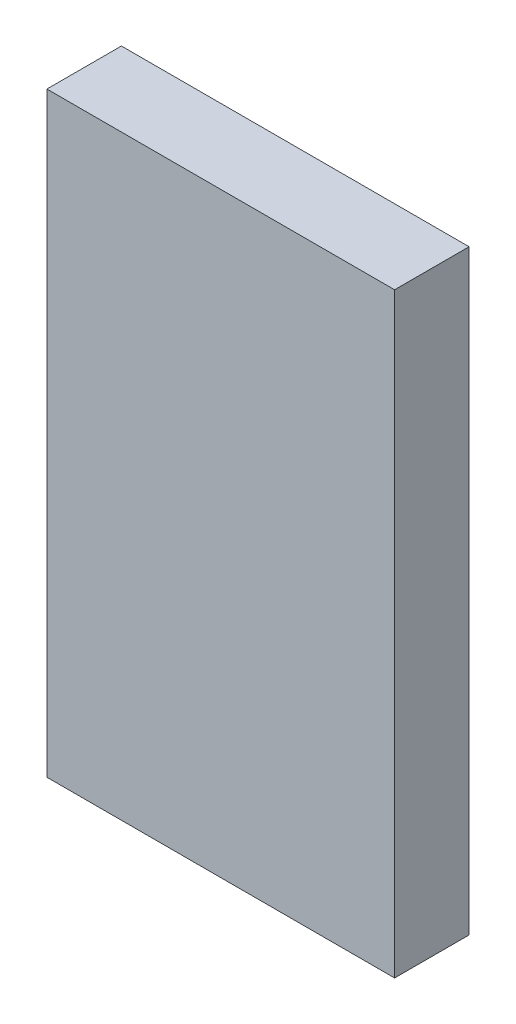
ISO-10303-21;
HEADER;
FILE_DESCRIPTION(('STEP AP214'),'2;1');
FILE_NAME('part.step','',(''),(''),'','','');
FILE_SCHEMA(('AUTOMOTIVE_DESIGN { 1 0 10303 214 1 1 1 1 }'));
ENDSEC;
DATA;
#1=APPLICATION_CONTEXT('core data for automotive mechanical design processes');
#2=APPLICATION_PROTOCOL_DEFINITION('international standard','automotive_design',2000,#1);
#3=PRODUCT_CONTEXT('',#1,'mechanical');
#4=PRODUCT('Part','Part','',(#3));
#5=PRODUCT_RELATED_PRODUCT_CATEGORY('part','',(#4));
#6=PRODUCT_DEFINITION_FORMATION('','',#4);
#7=PRODUCT_DEFINITION_CONTEXT('part definition',#1,'design');
#8=PRODUCT_DEFINITION('design','',#6,#7);
#9=PRODUCT_DEFINITION_SHAPE('','',#8);
#10=(LENGTH_UNIT() NAMED_UNIT(*) SI_UNIT(.MILLI.,.METRE.));
#11=(NAMED_UNIT(*) PLANE_ANGLE_UNIT() SI_UNIT($,.RADIAN.));
#12=(NAMED_UNIT(*) SI_UNIT($,.STERADIAN.) SOLID_ANGLE_UNIT());
#13=UNCERTAINTY_MEASURE_WITH_UNIT(LENGTH_MEASURE(1.E-05),#10,'distance_accuracy_value','');
#14=(GEOMETRIC_REPRESENTATION_CONTEXT(3) GLOBAL_UNCERTAINTY_ASSIGNED_CONTEXT((#13)) GLOBAL_UNIT_ASSIGNED_CONTEXT((#10,
#11,#12)) REPRESENTATION_CONTEXT('',''));
#15=CARTESIAN_POINT('',(0.,0.,0.));
#16=DIRECTION('',(0.,0.,1.));
#17=DIRECTION('',(1.,0.,0.));
#18=AXIS2_PLACEMENT_3D('',#15,#16,#17);
#19=CARTESIAN_POINT('',(0.,0.,7.62));
#20=DIRECTION('',(1.,0.,0.));
#21=DIRECTION('',(0.,0.,-1.));
#22=AXIS2_PLACEMENT_3D('',#19,#20,#21);
#23=PLANE('',#22);
#24=DIRECTION('',(0.,-1.,0.));
#25=VECTOR('',#24,1.);
#26=CARTESIAN_POINT('',(0.,0.,0.));
#27=LINE('',#26,#25);
#28=CARTESIAN_POINT('',(0.,60.96,0.));
#29=VERTEX_POINT('',#28);
#30=CARTESIAN_POINT('',(0.,0.,0.));
#31=VERTEX_POINT('',#30);
#32=EDGE_CURVE('E96',#29,#31,#27,.T.);
#33=ORIENTED_EDGE('',*,*,#32,.T.);
#34=DIRECTION('',(0.,0.,-1.));
#35=VECTOR('',#34,1.);
#36=CARTESIAN_POINT('',(0.,0.,7.62));
#37=LINE('',#36,#35);
#38=CARTESIAN_POINT('',(0.,0.,7.62));
#39=VERTEX_POINT('',#38);
#40=EDGE_CURVE('E11',#39,#31,#37,.T.);
#41=ORIENTED_EDGE('',*,*,#40,.F.);
#42=DIRECTION('',(0.,-1.,0.));
#43=VECTOR('',#42,1.);
#44=CARTESIAN_POINT('',(0.,0.,7.62));
#45=LINE('',#44,#43);
#46=CARTESIAN_POINT('',(0.,60.96,7.62));
#47=VERTEX_POINT('',#46);
#48=EDGE_CURVE('E84',#47,#39,#45,.T.);
#49=ORIENTED_EDGE('',*,*,#48,.F.);
#50=DIRECTION('',(0.,0.,-1.));
#51=VECTOR('',#50,1.);
#52=CARTESIAN_POINT('',(0.,60.96,7.62));
#53=LINE('',#52,#51);
#54=EDGE_CURVE('E92',#47,#29,#53,.T.);
#55=ORIENTED_EDGE('',*,*,#54,.T.);
#56=EDGE_LOOP('',(#33,#41,#49,#55));
#57=FACE_BOUND('',#56,.T.);
#58=ADVANCED_FACE('F33',(#57),#23,.F.);
#59=CARTESIAN_POINT('',(0.,0.,7.62));
#60=DIRECTION('',(0.,1.,0.));
#61=DIRECTION('',(0.,0.,1.));
#62=AXIS2_PLACEMENT_3D('',#59,#60,#61);
#63=PLANE('',#62);
#64=DIRECTION('',(1.,0.,0.));
#65=VECTOR('',#64,1.);
#66=CARTESIAN_POINT('',(0.,0.,0.));
#67=LINE('',#66,#65);
#68=CARTESIAN_POINT('',(35.56,0.,0.));
#69=VERTEX_POINT('',#68);
#70=EDGE_CURVE('E88',#31,#69,#67,.T.);
#71=ORIENTED_EDGE('',*,*,#70,.T.);
#72=DIRECTION('',(0.,0.,-1.));
#73=VECTOR('',#72,1.);
#74=CARTESIAN_POINT('',(35.56,0.,7.62));
#75=LINE('',#74,#73);
#76=CARTESIAN_POINT('',(35.56,0.,7.62));
#77=VERTEX_POINT('',#76);
#78=EDGE_CURVE('E41',#77,#69,#75,.T.);
#79=ORIENTED_EDGE('',*,*,#78,.F.);
#80=DIRECTION('',(1.,0.,0.));
#81=VECTOR('',#80,1.);
#82=CARTESIAN_POINT('',(0.,0.,7.62));
#83=LINE('',#82,#81);
#84=EDGE_CURVE('E79',#39,#77,#83,.T.);
#85=ORIENTED_EDGE('',*,*,#84,.F.);
#86=ORIENTED_EDGE('',*,*,#40,.T.);
#87=EDGE_LOOP('',(#71,#79,#85,#86));
#88=FACE_BOUND('',#87,.T.);
#89=ADVANCED_FACE('F87',(#88),#63,.F.);
#90=CARTESIAN_POINT('',(35.56,0.,7.62));
#91=DIRECTION('',(-1.,0.,0.));
#92=DIRECTION('',(0.,-1.,0.));
#93=AXIS2_PLACEMENT_3D('',#90,#91,#92);
#94=PLANE('',#93);
#95=DIRECTION('',(0.,1.,0.));
#96=VECTOR('',#95,1.);
#97=CARTESIAN_POINT('',(35.56,0.,0.));
#98=LINE('',#97,#96);
#99=CARTESIAN_POINT('',(35.56,60.96,0.));
#100=VERTEX_POINT('',#99);
#101=EDGE_CURVE('E66',#69,#100,#98,.T.);
#102=ORIENTED_EDGE('',*,*,#101,.T.);
#103=DIRECTION('',(0.,0.,-1.));
#104=VECTOR('',#103,1.);
#105=CARTESIAN_POINT('',(35.56,60.96,7.62));
#106=LINE('',#105,#104);
#107=CARTESIAN_POINT('',(35.56,60.96,7.62));
#108=VERTEX_POINT('',#107);
#109=EDGE_CURVE('E89',#108,#100,#106,.T.);
#110=ORIENTED_EDGE('',*,*,#109,.F.);
#111=DIRECTION('',(0.,1.,0.));
#112=VECTOR('',#111,1.);
#113=CARTESIAN_POINT('',(35.56,0.,7.62));
#114=LINE('',#113,#112);
#115=EDGE_CURVE('E82',#77,#108,#114,.T.);
#116=ORIENTED_EDGE('',*,*,#115,.F.);
#117=ORIENTED_EDGE('',*,*,#78,.T.);
#118=EDGE_LOOP('',(#102,#110,#116,#117));
#119=FACE_BOUND('',#118,.T.);
#120=ADVANCED_FACE('F90',(#119),#94,.F.);
#121=CARTESIAN_POINT('',(0.,60.96,7.62));
#122=DIRECTION('',(0.,-1.,0.));
#123=DIRECTION('',(0.,0.,-1.));
#124=AXIS2_PLACEMENT_3D('',#121,#122,#123);
#125=PLANE('',#124);
#126=DIRECTION('',(-1.,0.,0.));
#127=VECTOR('',#126,1.);
#128=CARTESIAN_POINT('',(0.,60.96,0.));
#129=LINE('',#128,#127);
#130=EDGE_CURVE('E72',#100,#29,#129,.T.);
#131=ORIENTED_EDGE('',*,*,#130,.T.);
#132=ORIENTED_EDGE('',*,*,#54,.F.);
#133=DIRECTION('',(-1.,0.,0.));
#134=VECTOR('',#133,1.);
#135=CARTESIAN_POINT('',(0.,60.96,7.62));
#136=LINE('',#135,#134);
#137=EDGE_CURVE('E49',#108,#47,#136,.T.);
#138=ORIENTED_EDGE('',*,*,#137,.F.);
#139=ORIENTED_EDGE('',*,*,#109,.T.);
#140=EDGE_LOOP('',(#131,#132,#138,#139));
#141=FACE_BOUND('',#140,.T.);
#142=ADVANCED_FACE('F103',(#141),#125,.F.);
#143=CARTESIAN_POINT('',(0.,0.,7.62));
#144=DIRECTION('',(0.,0.,-1.));
#145=DIRECTION('',(-1.,0.,0.));
#146=AXIS2_PLACEMENT_3D('',#143,#144,#145);
#147=PLANE('',#146);
#148=ORIENTED_EDGE('',*,*,#48,.T.);
#149=ORIENTED_EDGE('',*,*,#84,.T.);
#150=ORIENTED_EDGE('',*,*,#115,.T.);
#151=ORIENTED_EDGE('',*,*,#137,.T.);
#152=EDGE_LOOP('',(#148,#149,#150,#151));
#153=FACE_BOUND('',#152,.T.);
#154=ADVANCED_FACE('F80',(#153),#147,.F.);
#155=CARTESIAN_POINT('',(0.,0.,0.));
#156=DIRECTION('',(0.,0.,-1.));
#157=DIRECTION('',(-1.,0.,0.));
#158=AXIS2_PLACEMENT_3D('',#155,#156,#157);
#159=PLANE('',#158);
#160=ORIENTED_EDGE('',*,*,#32,.F.);
#161=ORIENTED_EDGE('',*,*,#130,.F.);
#162=ORIENTED_EDGE('',*,*,#101,.F.);
#163=ORIENTED_EDGE('',*,*,#70,.F.);
#164=EDGE_LOOP('',(#160,#161,#162,#163));
#165=FACE_BOUND('',#164,.T.);
#166=ADVANCED_FACE('F106',(#165),#159,.T.);
#167=CLOSED_SHELL('',(#58,#89,#120,#142,#154,#166));
#168=MANIFOLD_SOLID_BREP('B2',#167);
#169=ADVANCED_BREP_SHAPE_REPRESENTATION('',(#18,#168),#14);
#170=SHAPE_DEFINITION_REPRESENTATION(#9,#169);
ENDSEC;
END-ISO-10303-21;
